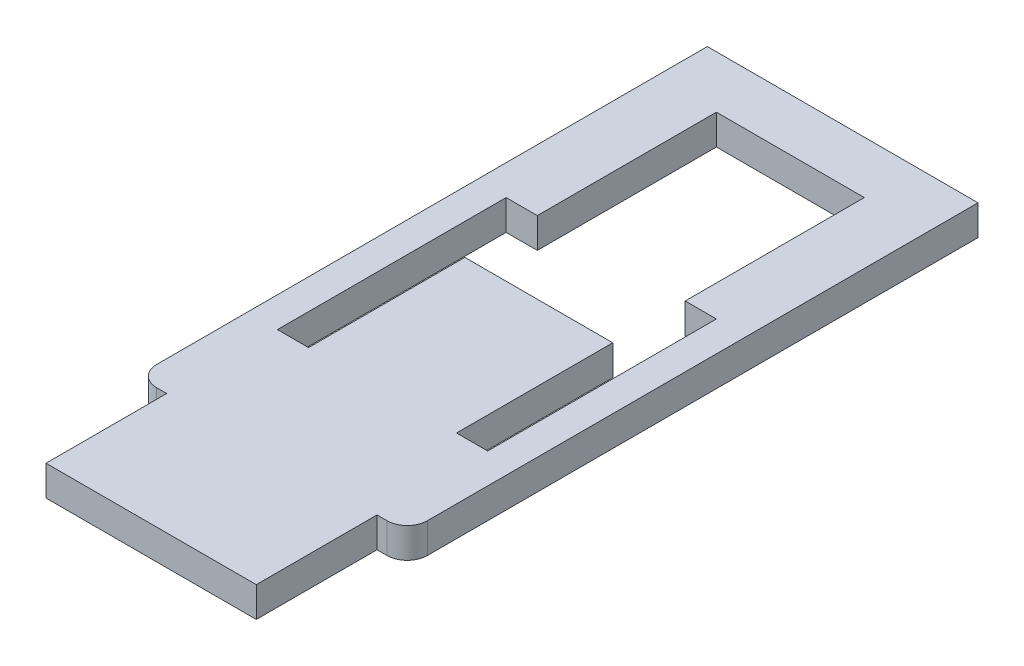
ISO-10303-21;
HEADER;
FILE_DESCRIPTION(('STEP AP214'),'2;1');
FILE_NAME('part.step','',(''),(''),'','','');
FILE_SCHEMA(('AUTOMOTIVE_DESIGN { 1 0 10303 214 1 1 1 1 }'));
ENDSEC;
DATA;
#1=APPLICATION_CONTEXT('core data for automotive mechanical design processes');
#2=APPLICATION_PROTOCOL_DEFINITION('international standard','automotive_design',2000,#1);
#3=PRODUCT_CONTEXT('',#1,'mechanical');
#4=PRODUCT('Part','Part','',(#3));
#5=PRODUCT_RELATED_PRODUCT_CATEGORY('part','',(#4));
#6=PRODUCT_DEFINITION_FORMATION('','',#4);
#7=PRODUCT_DEFINITION_CONTEXT('part definition',#1,'design');
#8=PRODUCT_DEFINITION('design','',#6,#7);
#9=PRODUCT_DEFINITION_SHAPE('','',#8);
#10=(LENGTH_UNIT() NAMED_UNIT(*) SI_UNIT(.MILLI.,.METRE.));
#11=(NAMED_UNIT(*) PLANE_ANGLE_UNIT() SI_UNIT($,.RADIAN.));
#12=(NAMED_UNIT(*) SI_UNIT($,.STERADIAN.) SOLID_ANGLE_UNIT());
#13=UNCERTAINTY_MEASURE_WITH_UNIT(LENGTH_MEASURE(1.E-05),#10,'distance_accuracy_value','');
#14=(GEOMETRIC_REPRESENTATION_CONTEXT(3) GLOBAL_UNCERTAINTY_ASSIGNED_CONTEXT((#13)) GLOBAL_UNIT_ASSIGNED_CONTEXT((#10,
#11,#12)) REPRESENTATION_CONTEXT('',''));
#15=CARTESIAN_POINT('',(0.,0.,0.));
#16=DIRECTION('',(0.,0.,1.));
#17=DIRECTION('',(1.,0.,0.));
#18=AXIS2_PLACEMENT_3D('',#15,#16,#17);
#19=CARTESIAN_POINT('',(7.35025,3.,0.));
#20=DIRECTION('',(-1.,0.,0.));
#21=DIRECTION('',(0.,0.,1.));
#22=AXIS2_PLACEMENT_3D('',#19,#20,#21);
#23=PLANE('',#22);
#24=DIRECTION('',(0.,0.,-1.));
#25=VECTOR('',#24,1.);
#26=CARTESIAN_POINT('',(7.35025,0.,0.));
#27=LINE('',#26,#25);
#28=CARTESIAN_POINT('',(7.35025,0.,-11.36565));
#29=VERTEX_POINT('',#28);
#30=CARTESIAN_POINT('',(7.35025,0.,-29.16565));
#31=VERTEX_POINT('',#30);
#32=EDGE_CURVE('E293',#29,#31,#27,.T.);
#33=ORIENTED_EDGE('',*,*,#32,.F.);
#34=DIRECTION('',(0.,-1.,0.));
#35=VECTOR('',#34,1.);
#36=CARTESIAN_POINT('',(7.35025,3.,-11.36565));
#37=LINE('',#36,#35);
#38=CARTESIAN_POINT('',(7.35025,3.,-11.36565));
#39=VERTEX_POINT('',#38);
#40=EDGE_CURVE('E350',#39,#29,#37,.T.);
#41=ORIENTED_EDGE('',*,*,#40,.F.);
#42=DIRECTION('',(0.,0.,-1.));
#43=VECTOR('',#42,1.);
#44=CARTESIAN_POINT('',(7.35025,3.,0.));
#45=LINE('',#44,#43);
#46=CARTESIAN_POINT('',(7.35025,3.,-29.16565));
#47=VERTEX_POINT('',#46);
#48=EDGE_CURVE('E239',#39,#47,#45,.T.);
#49=ORIENTED_EDGE('',*,*,#48,.T.);
#50=DIRECTION('',(0.,-1.,0.));
#51=VECTOR('',#50,1.);
#52=CARTESIAN_POINT('',(7.35025,3.,-29.16565));
#53=LINE('',#52,#51);
#54=EDGE_CURVE('E204',#47,#31,#53,.T.);
#55=ORIENTED_EDGE('',*,*,#54,.T.);
#56=EDGE_LOOP('',(#33,#41,#49,#55));
#57=FACE_BOUND('',#56,.T.);
#58=ADVANCED_FACE('F45',(#57),#23,.T.);
#59=CARTESIAN_POINT('',(0.,3.,-11.36565));
#60=DIRECTION('',(0.,0.,1.));
#61=DIRECTION('',(1.,0.,0.));
#62=AXIS2_PLACEMENT_3D('',#59,#60,#61);
#63=PLANE('',#62);
#64=DIRECTION('',(-1.,0.,0.));
#65=VECTOR('',#64,1.);
#66=CARTESIAN_POINT('',(0.,0.,-11.36565));
#67=LINE('',#66,#65);
#68=CARTESIAN_POINT('',(10.45025,0.,-11.36565));
#69=VERTEX_POINT('',#68);
#70=EDGE_CURVE('E296',#69,#29,#67,.T.);
#71=ORIENTED_EDGE('',*,*,#70,.F.);
#72=DIRECTION('',(0.,-1.,0.));
#73=VECTOR('',#72,1.);
#74=CARTESIAN_POINT('',(10.45025,3.,-11.36565));
#75=LINE('',#74,#73);
#76=CARTESIAN_POINT('',(10.45025,3.,-11.36565));
#77=VERTEX_POINT('',#76);
#78=EDGE_CURVE('E348',#77,#69,#75,.T.);
#79=ORIENTED_EDGE('',*,*,#78,.F.);
#80=DIRECTION('',(-1.,0.,0.));
#81=VECTOR('',#80,1.);
#82=CARTESIAN_POINT('',(0.,3.,-11.36565));
#83=LINE('',#82,#81);
#84=EDGE_CURVE('E242',#77,#39,#83,.T.);
#85=ORIENTED_EDGE('',*,*,#84,.T.);
#86=ORIENTED_EDGE('',*,*,#40,.T.);
#87=EDGE_LOOP('',(#71,#79,#85,#86));
#88=FACE_BOUND('',#87,.T.);
#89=ADVANCED_FACE('F405',(#88),#63,.T.);
#90=CARTESIAN_POINT('',(10.45025,3.,0.));
#91=DIRECTION('',(-1.,0.,0.));
#92=DIRECTION('',(0.,0.,1.));
#93=AXIS2_PLACEMENT_3D('',#90,#91,#92);
#94=PLANE('',#93);
#95=DIRECTION('',(0.,0.,-1.));
#96=VECTOR('',#95,1.);
#97=CARTESIAN_POINT('',(10.45025,0.,0.));
#98=LINE('',#97,#96);
#99=CARTESIAN_POINT('',(10.45025,0.,11.36565));
#100=VERTEX_POINT('',#99);
#101=EDGE_CURVE('E299',#100,#69,#98,.T.);
#102=ORIENTED_EDGE('',*,*,#101,.F.);
#103=DIRECTION('',(0.,-1.,0.));
#104=VECTOR('',#103,1.);
#105=CARTESIAN_POINT('',(10.45025,3.,11.36565));
#106=LINE('',#105,#104);
#107=CARTESIAN_POINT('',(10.45025,3.,11.36565));
#108=VERTEX_POINT('',#107);
#109=EDGE_CURVE('E346',#108,#100,#106,.T.);
#110=ORIENTED_EDGE('',*,*,#109,.F.);
#111=DIRECTION('',(0.,0.,-1.));
#112=VECTOR('',#111,1.);
#113=CARTESIAN_POINT('',(10.45025,3.,0.));
#114=LINE('',#113,#112);
#115=EDGE_CURVE('E245',#108,#77,#114,.T.);
#116=ORIENTED_EDGE('',*,*,#115,.T.);
#117=ORIENTED_EDGE('',*,*,#78,.T.);
#118=EDGE_LOOP('',(#102,#110,#116,#117));
#119=FACE_BOUND('',#118,.T.);
#120=ADVANCED_FACE('F411',(#119),#94,.T.);
#121=CARTESIAN_POINT('',(0.,3.,11.36565));
#122=DIRECTION('',(0.,0.,1.));
#123=DIRECTION('',(1.,0.,0.));
#124=AXIS2_PLACEMENT_3D('',#121,#122,#123);
#125=PLANE('',#124);
#126=DIRECTION('',(-1.,0.,0.));
#127=VECTOR('',#126,1.);
#128=CARTESIAN_POINT('',(0.,0.,11.36565));
#129=LINE('',#128,#127);
#130=CARTESIAN_POINT('',(7.35025,0.,11.36565));
#131=VERTEX_POINT('',#130);
#132=EDGE_CURVE('E302',#100,#131,#129,.T.);
#133=ORIENTED_EDGE('',*,*,#132,.T.);
#134=DIRECTION('',(0.,-1.,0.));
#135=VECTOR('',#134,1.);
#136=CARTESIAN_POINT('',(7.35025,3.,11.36565));
#137=LINE('',#136,#135);
#138=CARTESIAN_POINT('',(7.35025,3.,11.36565));
#139=VERTEX_POINT('',#138);
#140=EDGE_CURVE('E343',#139,#131,#137,.T.);
#141=ORIENTED_EDGE('',*,*,#140,.F.);
#142=DIRECTION('',(-1.,0.,0.));
#143=VECTOR('',#142,1.);
#144=CARTESIAN_POINT('',(0.,3.,11.36565));
#145=LINE('',#144,#143);
#146=EDGE_CURVE('E248',#108,#139,#145,.T.);
#147=ORIENTED_EDGE('',*,*,#146,.F.);
#148=ORIENTED_EDGE('',*,*,#109,.T.);
#149=EDGE_LOOP('',(#133,#141,#147,#148));
#150=FACE_BOUND('',#149,.T.);
#151=ADVANCED_FACE('F468',(#150),#125,.F.);
#152=CARTESIAN_POINT('',(7.35025,3.,0.));
#153=DIRECTION('',(-1.,0.,0.));
#154=DIRECTION('',(0.,0.,1.));
#155=AXIS2_PLACEMENT_3D('',#152,#153,#154);
#156=PLANE('',#155);
#157=DIRECTION('',(0.,0.,-1.));
#158=VECTOR('',#157,1.);
#159=CARTESIAN_POINT('',(7.35025,0.,0.));
#160=LINE('',#159,#158);
#161=CARTESIAN_POINT('',(7.35025,0.,-4.16565000000001));
#162=VERTEX_POINT('',#161);
#163=EDGE_CURVE('E305',#131,#162,#160,.T.);
#164=ORIENTED_EDGE('',*,*,#163,.T.);
#165=DIRECTION('',(0.,-1.,0.));
#166=VECTOR('',#165,1.);
#167=CARTESIAN_POINT('',(7.35025,3.,-4.16565000000001));
#168=LINE('',#167,#166);
#169=CARTESIAN_POINT('',(7.35025,3.,-4.16565000000001));
#170=VERTEX_POINT('',#169);
#171=EDGE_CURVE('E341',#170,#162,#168,.T.);
#172=ORIENTED_EDGE('',*,*,#171,.F.);
#173=DIRECTION('',(0.,0.,-1.));
#174=VECTOR('',#173,1.);
#175=CARTESIAN_POINT('',(7.35025,3.,0.));
#176=LINE('',#175,#174);
#177=EDGE_CURVE('E251',#139,#170,#176,.T.);
#178=ORIENTED_EDGE('',*,*,#177,.F.);
#179=ORIENTED_EDGE('',*,*,#140,.T.);
#180=EDGE_LOOP('',(#164,#172,#178,#179));
#181=FACE_BOUND('',#180,.T.);
#182=ADVANCED_FACE('F464',(#181),#156,.F.);
#183=CARTESIAN_POINT('',(0.,3.,-4.16565000000001));
#184=DIRECTION('',(0.,0.,-1.));
#185=DIRECTION('',(-1.,0.,0.));
#186=AXIS2_PLACEMENT_3D('',#183,#184,#185);
#187=PLANE('',#186);
#188=DIRECTION('',(1.,0.,0.));
#189=VECTOR('',#188,1.);
#190=CARTESIAN_POINT('',(0.,0.,-4.16565000000001));
#191=LINE('',#190,#189);
#192=CARTESIAN_POINT('',(-7.35025,0.,-4.16565000000001));
#193=VERTEX_POINT('',#192);
#194=EDGE_CURVE('E308',#193,#162,#191,.T.);
#195=ORIENTED_EDGE('',*,*,#194,.F.);
#196=DIRECTION('',(0.,-1.,0.));
#197=VECTOR('',#196,1.);
#198=CARTESIAN_POINT('',(-7.35025,3.,-4.16565000000001));
#199=LINE('',#198,#197);
#200=CARTESIAN_POINT('',(-7.35025,3.,-4.16565000000001));
#201=VERTEX_POINT('',#200);
#202=EDGE_CURVE('E339',#201,#193,#199,.T.);
#203=ORIENTED_EDGE('',*,*,#202,.F.);
#204=DIRECTION('',(1.,0.,0.));
#205=VECTOR('',#204,1.);
#206=CARTESIAN_POINT('',(0.,3.,-4.16565000000001));
#207=LINE('',#206,#205);
#208=EDGE_CURVE('E253',#201,#170,#207,.T.);
#209=ORIENTED_EDGE('',*,*,#208,.T.);
#210=ORIENTED_EDGE('',*,*,#171,.T.);
#211=EDGE_LOOP('',(#195,#203,#209,#210));
#212=FACE_BOUND('',#211,.T.);
#213=ADVANCED_FACE('F460',(#212),#187,.T.);
#214=CARTESIAN_POINT('',(-7.35025,3.,0.));
#215=DIRECTION('',(-1.,0.,0.));
#216=DIRECTION('',(0.,0.,1.));
#217=AXIS2_PLACEMENT_3D('',#214,#215,#216);
#218=PLANE('',#217);
#219=DIRECTION('',(0.,0.,-1.));
#220=VECTOR('',#219,1.);
#221=CARTESIAN_POINT('',(-7.35025,0.,0.));
#222=LINE('',#221,#220);
#223=CARTESIAN_POINT('',(-7.35025,0.,11.36565));
#224=VERTEX_POINT('',#223);
#225=EDGE_CURVE('E311',#224,#193,#222,.T.);
#226=ORIENTED_EDGE('',*,*,#225,.F.);
#227=DIRECTION('',(0.,-1.,0.));
#228=VECTOR('',#227,1.);
#229=CARTESIAN_POINT('',(-7.35025,3.,11.36565));
#230=LINE('',#229,#228);
#231=CARTESIAN_POINT('',(-7.35025,3.,11.36565));
#232=VERTEX_POINT('',#231);
#233=EDGE_CURVE('E337',#232,#224,#230,.T.);
#234=ORIENTED_EDGE('',*,*,#233,.F.);
#235=DIRECTION('',(0.,0.,-1.));
#236=VECTOR('',#235,1.);
#237=CARTESIAN_POINT('',(-7.35025,3.,0.));
#238=LINE('',#237,#236);
#239=EDGE_CURVE('E256',#232,#201,#238,.T.);
#240=ORIENTED_EDGE('',*,*,#239,.T.);
#241=ORIENTED_EDGE('',*,*,#202,.T.);
#242=EDGE_LOOP('',(#226,#234,#240,#241));
#243=FACE_BOUND('',#242,.T.);
#244=ADVANCED_FACE('F456',(#243),#218,.T.);
#245=CARTESIAN_POINT('',(0.,3.,11.36565));
#246=DIRECTION('',(0.,0.,-1.));
#247=DIRECTION('',(-1.,0.,0.));
#248=AXIS2_PLACEMENT_3D('',#245,#246,#247);
#249=PLANE('',#248);
#250=DIRECTION('',(1.,0.,0.));
#251=VECTOR('',#250,1.);
#252=CARTESIAN_POINT('',(0.,0.,11.36565));
#253=LINE('',#252,#251);
#254=CARTESIAN_POINT('',(-10.45025,0.,11.36565));
#255=VERTEX_POINT('',#254);
#256=EDGE_CURVE('E314',#255,#224,#253,.T.);
#257=ORIENTED_EDGE('',*,*,#256,.F.);
#258=DIRECTION('',(0.,-1.,0.));
#259=VECTOR('',#258,1.);
#260=CARTESIAN_POINT('',(-10.45025,3.,11.36565));
#261=LINE('',#260,#259);
#262=CARTESIAN_POINT('',(-10.45025,3.,11.36565));
#263=VERTEX_POINT('',#262);
#264=EDGE_CURVE('E335',#263,#255,#261,.T.);
#265=ORIENTED_EDGE('',*,*,#264,.F.);
#266=DIRECTION('',(1.,0.,0.));
#267=VECTOR('',#266,1.);
#268=CARTESIAN_POINT('',(0.,3.,11.36565));
#269=LINE('',#268,#267);
#270=EDGE_CURVE('E259',#263,#232,#269,.T.);
#271=ORIENTED_EDGE('',*,*,#270,.T.);
#272=ORIENTED_EDGE('',*,*,#233,.T.);
#273=EDGE_LOOP('',(#257,#265,#271,#272));
#274=FACE_BOUND('',#273,.T.);
#275=ADVANCED_FACE('F452',(#274),#249,.T.);
#276=CARTESIAN_POINT('',(-10.45025,3.,0.));
#277=DIRECTION('',(-1.,0.,0.));
#278=DIRECTION('',(0.,0.,1.));
#279=AXIS2_PLACEMENT_3D('',#276,#277,#278);
#280=PLANE('',#279);
#281=DIRECTION('',(0.,0.,-1.));
#282=VECTOR('',#281,1.);
#283=CARTESIAN_POINT('',(-10.45025,0.,0.));
#284=LINE('',#283,#282);
#285=CARTESIAN_POINT('',(-10.45025,0.,-11.36565));
#286=VERTEX_POINT('',#285);
#287=EDGE_CURVE('E317',#255,#286,#284,.T.);
#288=ORIENTED_EDGE('',*,*,#287,.T.);
#289=DIRECTION('',(0.,-1.,0.));
#290=VECTOR('',#289,1.);
#291=CARTESIAN_POINT('',(-10.45025,3.,-11.36565));
#292=LINE('',#291,#290);
#293=CARTESIAN_POINT('',(-10.45025,3.,-11.36565));
#294=VERTEX_POINT('',#293);
#295=EDGE_CURVE('E332',#294,#286,#292,.T.);
#296=ORIENTED_EDGE('',*,*,#295,.F.);
#297=DIRECTION('',(0.,0.,-1.));
#298=VECTOR('',#297,1.);
#299=CARTESIAN_POINT('',(-10.45025,3.,0.));
#300=LINE('',#299,#298);
#301=EDGE_CURVE('E262',#263,#294,#300,.T.);
#302=ORIENTED_EDGE('',*,*,#301,.F.);
#303=ORIENTED_EDGE('',*,*,#264,.T.);
#304=EDGE_LOOP('',(#288,#296,#302,#303));
#305=FACE_BOUND('',#304,.T.);
#306=ADVANCED_FACE('F444',(#305),#280,.F.);
#307=CARTESIAN_POINT('',(0.,3.,-11.36565));
#308=DIRECTION('',(0.,0.,-1.));
#309=DIRECTION('',(-1.,0.,0.));
#310=AXIS2_PLACEMENT_3D('',#307,#308,#309);
#311=PLANE('',#310);
#312=DIRECTION('',(1.,0.,0.));
#313=VECTOR('',#312,1.);
#314=CARTESIAN_POINT('',(0.,0.,-11.36565));
#315=LINE('',#314,#313);
#316=CARTESIAN_POINT('',(-7.35025,0.,-11.36565));
#317=VERTEX_POINT('',#316);
#318=EDGE_CURVE('E320',#286,#317,#315,.T.);
#319=ORIENTED_EDGE('',*,*,#318,.T.);
#320=DIRECTION('',(0.,-1.,0.));
#321=VECTOR('',#320,1.);
#322=CARTESIAN_POINT('',(-7.35025,3.,-11.36565));
#323=LINE('',#322,#321);
#324=CARTESIAN_POINT('',(-7.35025,3.,-11.36565));
#325=VERTEX_POINT('',#324);
#326=EDGE_CURVE('E329',#325,#317,#323,.T.);
#327=ORIENTED_EDGE('',*,*,#326,.F.);
#328=DIRECTION('',(1.,0.,0.));
#329=VECTOR('',#328,1.);
#330=CARTESIAN_POINT('',(0.,3.,-11.36565));
#331=LINE('',#330,#329);
#332=EDGE_CURVE('E265',#294,#325,#331,.T.);
#333=ORIENTED_EDGE('',*,*,#332,.F.);
#334=ORIENTED_EDGE('',*,*,#295,.T.);
#335=EDGE_LOOP('',(#319,#327,#333,#334));
#336=FACE_BOUND('',#335,.T.);
#337=ADVANCED_FACE('F438',(#336),#311,.F.);
#338=CARTESIAN_POINT('',(-7.35025,3.,0.));
#339=DIRECTION('',(-1.,0.,0.));
#340=DIRECTION('',(0.,0.,1.));
#341=AXIS2_PLACEMENT_3D('',#338,#339,#340);
#342=PLANE('',#341);
#343=DIRECTION('',(0.,0.,-1.));
#344=VECTOR('',#343,1.);
#345=CARTESIAN_POINT('',(-7.35025,0.,0.));
#346=LINE('',#345,#344);
#347=CARTESIAN_POINT('',(-7.35025,0.,-29.16565));
#348=VERTEX_POINT('',#347);
#349=EDGE_CURVE('E224',#317,#348,#346,.T.);
#350=ORIENTED_EDGE('',*,*,#349,.T.);
#351=DIRECTION('',(0.,-1.,0.));
#352=VECTOR('',#351,1.);
#353=CARTESIAN_POINT('',(-7.35025,3.,-29.16565));
#354=LINE('',#353,#352);
#355=CARTESIAN_POINT('',(-7.35025,3.,-29.16565));
#356=VERTEX_POINT('',#355);
#357=EDGE_CURVE('E326',#356,#348,#354,.T.);
#358=ORIENTED_EDGE('',*,*,#357,.F.);
#359=DIRECTION('',(0.,0.,-1.));
#360=VECTOR('',#359,1.);
#361=CARTESIAN_POINT('',(-7.35025,3.,0.));
#362=LINE('',#361,#360);
#363=EDGE_CURVE('E268',#325,#356,#362,.T.);
#364=ORIENTED_EDGE('',*,*,#363,.F.);
#365=ORIENTED_EDGE('',*,*,#326,.T.);
#366=EDGE_LOOP('',(#350,#358,#364,#365));
#367=FACE_BOUND('',#366,.T.);
#368=ADVANCED_FACE('F434',(#367),#342,.F.);
#369=CARTESIAN_POINT('',(10.45025,3.,0.));
#370=DIRECTION('',(1.,0.,0.));
#371=DIRECTION('',(0.,0.,-1.));
#372=AXIS2_PLACEMENT_3D('',#369,#370,#371);
#373=PLANE('',#372);
#374=DIRECTION('',(0.,0.,1.));
#375=VECTOR('',#374,1.);
#376=CARTESIAN_POINT('',(10.45025,0.,0.));
#377=LINE('',#376,#375);
#378=CARTESIAN_POINT('',(10.45025,0.,22.36565));
#379=VERTEX_POINT('',#378);
#380=CARTESIAN_POINT('',(10.45025,0.,34.36565));
#381=VERTEX_POINT('',#380);
#382=EDGE_CURVE('E200',#379,#381,#377,.T.);
#383=ORIENTED_EDGE('',*,*,#382,.F.);
#384=DIRECTION('',(0.,-1.,0.));
#385=VECTOR('',#384,1.);
#386=CARTESIAN_POINT('',(10.45025,3.,22.36565));
#387=LINE('',#386,#385);
#388=CARTESIAN_POINT('',(10.45025,3.,22.36565));
#389=VERTEX_POINT('',#388);
#390=EDGE_CURVE('E194',#389,#379,#387,.T.);
#391=ORIENTED_EDGE('',*,*,#390,.F.);
#392=DIRECTION('',(0.,0.,1.));
#393=VECTOR('',#392,1.);
#394=CARTESIAN_POINT('',(10.45025,3.,0.));
#395=LINE('',#394,#393);
#396=CARTESIAN_POINT('',(10.45025,3.,34.36565));
#397=VERTEX_POINT('',#396);
#398=EDGE_CURVE('E198',#389,#397,#395,.T.);
#399=ORIENTED_EDGE('',*,*,#398,.T.);
#400=DIRECTION('',(0.,-1.,0.));
#401=VECTOR('',#400,1.);
#402=CARTESIAN_POINT('',(10.45025,3.,34.36565));
#403=LINE('',#402,#401);
#404=EDGE_CURVE('E273',#397,#381,#403,.T.);
#405=ORIENTED_EDGE('',*,*,#404,.T.);
#406=EDGE_LOOP('',(#383,#391,#399,#405));
#407=FACE_BOUND('',#406,.T.);
#408=ADVANCED_FACE('F196',(#407),#373,.T.);
#409=CARTESIAN_POINT('',(0.,3.,22.36565));
#410=DIRECTION('',(0.,0.,-1.));
#411=DIRECTION('',(-1.,0.,0.));
#412=AXIS2_PLACEMENT_3D('',#409,#410,#411);
#413=PLANE('',#412);
#414=DIRECTION('',(1.,0.,0.));
#415=VECTOR('',#414,1.);
#416=CARTESIAN_POINT('',(0.,0.,22.36565));
#417=LINE('',#416,#415);
#418=CARTESIAN_POINT('',(11.45025,0.,22.36565));
#419=VERTEX_POINT('',#418);
#420=EDGE_CURVE('E275',#379,#419,#417,.T.);
#421=ORIENTED_EDGE('',*,*,#420,.T.);
#422=DIRECTION('',(0.,-1.,0.));
#423=VECTOR('',#422,1.);
#424=CARTESIAN_POINT('',(11.45025,3.,22.36565));
#425=LINE('',#424,#423);
#426=CARTESIAN_POINT('',(11.45025,3.,22.36565));
#427=VERTEX_POINT('',#426);
#428=EDGE_CURVE('E211',#419,#427,#425,.F.);
#429=ORIENTED_EDGE('',*,*,#428,.T.);
#430=DIRECTION('',(1.,0.,0.));
#431=VECTOR('',#430,1.);
#432=CARTESIAN_POINT('',(0.,3.,22.36565));
#433=LINE('',#432,#431);
#434=EDGE_CURVE('E208',#389,#427,#433,.T.);
#435=ORIENTED_EDGE('',*,*,#434,.F.);
#436=ORIENTED_EDGE('',*,*,#390,.T.);
#437=EDGE_LOOP('',(#421,#429,#435,#436));
#438=FACE_BOUND('',#437,.T.);
#439=ADVANCED_FACE('F209',(#438),#413,.F.);
#440=CARTESIAN_POINT('',(13.45025,3.,0.));
#441=DIRECTION('',(-1.,0.,0.));
#442=DIRECTION('',(0.,0.,1.));
#443=AXIS2_PLACEMENT_3D('',#440,#441,#442);
#444=PLANE('',#443);
#445=DIRECTION('',(0.,0.,-1.));
#446=VECTOR('',#445,1.);
#447=CARTESIAN_POINT('',(13.45025,3.,0.));
#448=LINE('',#447,#446);
#449=CARTESIAN_POINT('',(13.45025,3.,20.36565));
#450=VERTEX_POINT('',#449);
#451=CARTESIAN_POINT('',(13.45025,3.,-34.36565));
#452=VERTEX_POINT('',#451);
#453=EDGE_CURVE('E213',#450,#452,#448,.T.);
#454=ORIENTED_EDGE('',*,*,#453,.F.);
#455=DIRECTION('',(0.,-1.,0.));
#456=VECTOR('',#455,1.);
#457=CARTESIAN_POINT('',(13.45025,3.,20.36565));
#458=LINE('',#457,#456);
#459=CARTESIAN_POINT('',(13.45025,0.,20.36565));
#460=VERTEX_POINT('',#459);
#461=EDGE_CURVE('E352',#450,#460,#458,.T.);
#462=ORIENTED_EDGE('',*,*,#461,.T.);
#463=DIRECTION('',(0.,0.,-1.));
#464=VECTOR('',#463,1.);
#465=CARTESIAN_POINT('',(13.45025,0.,0.));
#466=LINE('',#465,#464);
#467=CARTESIAN_POINT('',(13.45025,0.,-34.36565));
#468=VERTEX_POINT('',#467);
#469=EDGE_CURVE('E277',#460,#468,#466,.T.);
#470=ORIENTED_EDGE('',*,*,#469,.T.);
#471=DIRECTION('',(0.,-1.,0.));
#472=VECTOR('',#471,1.);
#473=CARTESIAN_POINT('',(13.45025,3.,-34.36565));
#474=LINE('',#473,#472);
#475=EDGE_CURVE('E205',#452,#468,#474,.T.);
#476=ORIENTED_EDGE('',*,*,#475,.F.);
#477=EDGE_LOOP('',(#454,#462,#470,#476));
#478=FACE_BOUND('',#477,.T.);
#479=ADVANCED_FACE('F395',(#478),#444,.F.);
#480=CARTESIAN_POINT('',(0.,3.,-34.36565));
#481=DIRECTION('',(0.,0.,-1.));
#482=DIRECTION('',(-1.,0.,0.));
#483=AXIS2_PLACEMENT_3D('',#480,#481,#482);
#484=PLANE('',#483);
#485=DIRECTION('',(1.,0.,0.));
#486=VECTOR('',#485,1.);
#487=CARTESIAN_POINT('',(0.,0.,-34.36565));
#488=LINE('',#487,#486);
#489=CARTESIAN_POINT('',(-13.45025,0.,-34.36565));
#490=VERTEX_POINT('',#489);
#491=EDGE_CURVE('E279',#490,#468,#488,.T.);
#492=ORIENTED_EDGE('',*,*,#491,.F.);
#493=DIRECTION('',(0.,-1.,0.));
#494=VECTOR('',#493,1.);
#495=CARTESIAN_POINT('',(-13.45025,3.,-34.36565));
#496=LINE('',#495,#494);
#497=CARTESIAN_POINT('',(-13.45025,3.,-34.36565));
#498=VERTEX_POINT('',#497);
#499=EDGE_CURVE('E358',#498,#490,#496,.T.);
#500=ORIENTED_EDGE('',*,*,#499,.F.);
#501=DIRECTION('',(1.,0.,0.));
#502=VECTOR('',#501,1.);
#503=CARTESIAN_POINT('',(0.,3.,-34.36565));
#504=LINE('',#503,#502);
#505=EDGE_CURVE('E228',#498,#452,#504,.T.);
#506=ORIENTED_EDGE('',*,*,#505,.T.);
#507=ORIENTED_EDGE('',*,*,#475,.T.);
#508=EDGE_LOOP('',(#492,#500,#506,#507));
#509=FACE_BOUND('',#508,.T.);
#510=ADVANCED_FACE('F399',(#509),#484,.T.);
#511=CARTESIAN_POINT('',(-13.45025,3.,0.));
#512=DIRECTION('',(-1.,0.,0.));
#513=DIRECTION('',(0.,0.,1.));
#514=AXIS2_PLACEMENT_3D('',#511,#512,#513);
#515=PLANE('',#514);
#516=DIRECTION('',(0.,0.,-1.));
#517=VECTOR('',#516,1.);
#518=CARTESIAN_POINT('',(-13.45025,0.,0.));
#519=LINE('',#518,#517);
#520=CARTESIAN_POINT('',(-13.45025,0.,20.36565));
#521=VERTEX_POINT('',#520);
#522=EDGE_CURVE('E282',#521,#490,#519,.T.);
#523=ORIENTED_EDGE('',*,*,#522,.F.);
#524=DIRECTION('',(0.,-1.,0.));
#525=VECTOR('',#524,1.);
#526=CARTESIAN_POINT('',(-13.45025,3.,20.36565));
#527=LINE('',#526,#525);
#528=CARTESIAN_POINT('',(-13.45025,3.,20.36565));
#529=VERTEX_POINT('',#528);
#530=EDGE_CURVE('E11',#521,#529,#527,.F.);
#531=ORIENTED_EDGE('',*,*,#530,.T.);
#532=DIRECTION('',(0.,0.,-1.));
#533=VECTOR('',#532,1.);
#534=CARTESIAN_POINT('',(-13.45025,3.,0.));
#535=LINE('',#534,#533);
#536=EDGE_CURVE('E231',#529,#498,#535,.T.);
#537=ORIENTED_EDGE('',*,*,#536,.T.);
#538=ORIENTED_EDGE('',*,*,#499,.T.);
#539=EDGE_LOOP('',(#523,#531,#537,#538));
#540=FACE_BOUND('',#539,.T.);
#541=ADVANCED_FACE('F424',(#540),#515,.T.);
#542=CARTESIAN_POINT('',(0.,3.,22.36565));
#543=DIRECTION('',(0.,0.,1.));
#544=DIRECTION('',(1.,0.,0.));
#545=AXIS2_PLACEMENT_3D('',#542,#543,#544);
#546=PLANE('',#545);
#547=DIRECTION('',(-1.,0.,0.));
#548=VECTOR('',#547,1.);
#549=CARTESIAN_POINT('',(0.,3.,22.36565));
#550=LINE('',#549,#548);
#551=CARTESIAN_POINT('',(-10.45025,3.,22.36565));
#552=VERTEX_POINT('',#551);
#553=CARTESIAN_POINT('',(-11.45025,3.,22.36565));
#554=VERTEX_POINT('',#553);
#555=EDGE_CURVE('E233',#552,#554,#550,.T.);
#556=ORIENTED_EDGE('',*,*,#555,.T.);
#557=DIRECTION('',(0.,-1.,0.));
#558=VECTOR('',#557,1.);
#559=CARTESIAN_POINT('',(-11.45025,3.,22.36565));
#560=LINE('',#559,#558);
#561=CARTESIAN_POINT('',(-11.45025,0.,22.36565));
#562=VERTEX_POINT('',#561);
#563=EDGE_CURVE('E53',#554,#562,#560,.T.);
#564=ORIENTED_EDGE('',*,*,#563,.T.);
#565=DIRECTION('',(-1.,0.,0.));
#566=VECTOR('',#565,1.);
#567=CARTESIAN_POINT('',(0.,0.,22.36565));
#568=LINE('',#567,#566);
#569=CARTESIAN_POINT('',(-10.45025,0.,22.36565));
#570=VERTEX_POINT('',#569);
#571=EDGE_CURVE('E284',#570,#562,#568,.T.);
#572=ORIENTED_EDGE('',*,*,#571,.F.);
#573=DIRECTION('',(0.,-1.,0.));
#574=VECTOR('',#573,1.);
#575=CARTESIAN_POINT('',(-10.45025,3.,22.36565));
#576=LINE('',#575,#574);
#577=EDGE_CURVE('E356',#552,#570,#576,.T.);
#578=ORIENTED_EDGE('',*,*,#577,.F.);
#579=EDGE_LOOP('',(#556,#564,#572,#578));
#580=FACE_BOUND('',#579,.T.);
#581=ADVANCED_FACE('F376',(#580),#546,.T.);
#582=CARTESIAN_POINT('',(-10.45025,3.,0.));
#583=DIRECTION('',(-1.,0.,0.));
#584=DIRECTION('',(0.,0.,1.));
#585=AXIS2_PLACEMENT_3D('',#582,#583,#584);
#586=PLANE('',#585);
#587=DIRECTION('',(0.,0.,-1.));
#588=VECTOR('',#587,1.);
#589=CARTESIAN_POINT('',(-10.45025,0.,0.));
#590=LINE('',#589,#588);
#591=CARTESIAN_POINT('',(-10.45025,0.,34.36565));
#592=VERTEX_POINT('',#591);
#593=EDGE_CURVE('E287',#592,#570,#590,.T.);
#594=ORIENTED_EDGE('',*,*,#593,.F.);
#595=DIRECTION('',(0.,-1.,0.));
#596=VECTOR('',#595,1.);
#597=CARTESIAN_POINT('',(-10.45025,3.,34.36565));
#598=LINE('',#597,#596);
#599=CARTESIAN_POINT('',(-10.45025,3.,34.36565));
#600=VERTEX_POINT('',#599);
#601=EDGE_CURVE('E354',#600,#592,#598,.T.);
#602=ORIENTED_EDGE('',*,*,#601,.F.);
#603=DIRECTION('',(0.,0.,-1.));
#604=VECTOR('',#603,1.);
#605=CARTESIAN_POINT('',(-10.45025,3.,0.));
#606=LINE('',#605,#604);
#607=EDGE_CURVE('E235',#600,#552,#606,.T.);
#608=ORIENTED_EDGE('',*,*,#607,.T.);
#609=ORIENTED_EDGE('',*,*,#577,.T.);
#610=EDGE_LOOP('',(#594,#602,#608,#609));
#611=FACE_BOUND('',#610,.T.);
#612=ADVANCED_FACE('F385',(#611),#586,.T.);
#613=CARTESIAN_POINT('',(0.,3.,34.36565));
#614=DIRECTION('',(0.,0.,-1.));
#615=DIRECTION('',(-1.,0.,0.));
#616=AXIS2_PLACEMENT_3D('',#613,#614,#615);
#617=PLANE('',#616);
#618=DIRECTION('',(1.,0.,0.));
#619=VECTOR('',#618,1.);
#620=CARTESIAN_POINT('',(0.,0.,34.36565));
#621=LINE('',#620,#619);
#622=EDGE_CURVE('E290',#592,#381,#621,.T.);
#623=ORIENTED_EDGE('',*,*,#622,.T.);
#624=ORIENTED_EDGE('',*,*,#404,.F.);
#625=DIRECTION('',(1.,0.,0.));
#626=VECTOR('',#625,1.);
#627=CARTESIAN_POINT('',(0.,3.,34.36565));
#628=LINE('',#627,#626);
#629=EDGE_CURVE('E219',#600,#397,#628,.T.);
#630=ORIENTED_EDGE('',*,*,#629,.F.);
#631=ORIENTED_EDGE('',*,*,#601,.T.);
#632=EDGE_LOOP('',(#623,#624,#630,#631));
#633=FACE_BOUND('',#632,.T.);
#634=ADVANCED_FACE('F387',(#633),#617,.F.);
#635=CARTESIAN_POINT('',(0.,3.,-29.16565));
#636=DIRECTION('',(0.,0.,-1.));
#637=DIRECTION('',(-1.,0.,0.));
#638=AXIS2_PLACEMENT_3D('',#635,#636,#637);
#639=PLANE('',#638);
#640=DIRECTION('',(1.,0.,0.));
#641=VECTOR('',#640,1.);
#642=CARTESIAN_POINT('',(0.,0.,-29.16565));
#643=LINE('',#642,#641);
#644=EDGE_CURVE('E221',#348,#31,#643,.T.);
#645=ORIENTED_EDGE('',*,*,#644,.T.);
#646=ORIENTED_EDGE('',*,*,#54,.F.);
#647=DIRECTION('',(1.,0.,0.));
#648=VECTOR('',#647,1.);
#649=CARTESIAN_POINT('',(0.,3.,-29.16565));
#650=LINE('',#649,#648);
#651=EDGE_CURVE('E271',#356,#47,#650,.T.);
#652=ORIENTED_EDGE('',*,*,#651,.F.);
#653=ORIENTED_EDGE('',*,*,#357,.T.);
#654=EDGE_LOOP('',(#645,#646,#652,#653));
#655=FACE_BOUND('',#654,.T.);
#656=ADVANCED_FACE('F419',(#655),#639,.F.);
#657=CARTESIAN_POINT('',(0.,3.,0.));
#658=DIRECTION('',(0.,1.,0.));
#659=DIRECTION('',(0.,0.,1.));
#660=AXIS2_PLACEMENT_3D('',#657,#658,#659);
#661=PLANE('',#660);
#662=ORIENTED_EDGE('',*,*,#434,.T.);
#663=CARTESIAN_POINT('',(11.45025,3.,20.36565));
#664=DIRECTION('',(0.,1.,0.));
#665=DIRECTION('',(0.,0.,1.));
#666=AXIS2_PLACEMENT_3D('',#663,#664,#665);
#667=CIRCLE('',#666,2.);
#668=EDGE_CURVE('E371',#427,#450,#667,.T.);
#669=ORIENTED_EDGE('',*,*,#668,.T.);
#670=ORIENTED_EDGE('',*,*,#453,.T.);
#671=ORIENTED_EDGE('',*,*,#505,.F.);
#672=ORIENTED_EDGE('',*,*,#536,.F.);
#673=CARTESIAN_POINT('',(-11.45025,3.,20.36565));
#674=DIRECTION('',(0.,1.,0.));
#675=DIRECTION('',(0.,0.,1.));
#676=AXIS2_PLACEMENT_3D('',#673,#674,#675);
#677=CIRCLE('',#676,2.);
#678=EDGE_CURVE('E60',#529,#554,#677,.T.);
#679=ORIENTED_EDGE('',*,*,#678,.T.);
#680=ORIENTED_EDGE('',*,*,#555,.F.);
#681=ORIENTED_EDGE('',*,*,#607,.F.);
#682=ORIENTED_EDGE('',*,*,#629,.T.);
#683=ORIENTED_EDGE('',*,*,#398,.F.);
#684=EDGE_LOOP('',(#662,#669,#670,#671,#672,#679,#680,#681,#682,#683));
#685=FACE_BOUND('',#684,.T.);
#686=ORIENTED_EDGE('',*,*,#48,.F.);
#687=ORIENTED_EDGE('',*,*,#84,.F.);
#688=ORIENTED_EDGE('',*,*,#115,.F.);
#689=ORIENTED_EDGE('',*,*,#146,.T.);
#690=ORIENTED_EDGE('',*,*,#177,.T.);
#691=ORIENTED_EDGE('',*,*,#208,.F.);
#692=ORIENTED_EDGE('',*,*,#239,.F.);
#693=ORIENTED_EDGE('',*,*,#270,.F.);
#694=ORIENTED_EDGE('',*,*,#301,.T.);
#695=ORIENTED_EDGE('',*,*,#332,.T.);
#696=ORIENTED_EDGE('',*,*,#363,.T.);
#697=ORIENTED_EDGE('',*,*,#651,.T.);
#698=EDGE_LOOP('',(#686,#687,#688,#689,#690,#691,#692,#693,#694,#695,#696,#697));
#699=FACE_BOUND('',#698,.T.);
#700=ADVANCED_FACE('F215',(#685,#699),#661,.T.);
#701=CARTESIAN_POINT('',(0.,0.,0.));
#702=DIRECTION('',(0.,1.,0.));
#703=DIRECTION('',(0.,0.,1.));
#704=AXIS2_PLACEMENT_3D('',#701,#702,#703);
#705=PLANE('',#704);
#706=ORIENTED_EDGE('',*,*,#469,.F.);
#707=CARTESIAN_POINT('',(11.45025,0.,20.36565));
#708=DIRECTION('',(0.,1.,0.));
#709=DIRECTION('',(0.,0.,1.));
#710=AXIS2_PLACEMENT_3D('',#707,#708,#709);
#711=CIRCLE('',#710,2.);
#712=EDGE_CURVE('E367',#460,#419,#711,.F.);
#713=ORIENTED_EDGE('',*,*,#712,.T.);
#714=ORIENTED_EDGE('',*,*,#420,.F.);
#715=ORIENTED_EDGE('',*,*,#382,.T.);
#716=ORIENTED_EDGE('',*,*,#622,.F.);
#717=ORIENTED_EDGE('',*,*,#593,.T.);
#718=ORIENTED_EDGE('',*,*,#571,.T.);
#719=CARTESIAN_POINT('',(-11.45025,0.,20.36565));
#720=DIRECTION('',(0.,1.,0.));
#721=DIRECTION('',(0.,0.,1.));
#722=AXIS2_PLACEMENT_3D('',#719,#720,#721);
#723=CIRCLE('',#722,2.);
#724=EDGE_CURVE('E365',#562,#521,#723,.F.);
#725=ORIENTED_EDGE('',*,*,#724,.T.);
#726=ORIENTED_EDGE('',*,*,#522,.T.);
#727=ORIENTED_EDGE('',*,*,#491,.T.);
#728=EDGE_LOOP('',(#706,#713,#714,#715,#716,#717,#718,#725,#726,#727));
#729=FACE_BOUND('',#728,.T.);
#730=ORIENTED_EDGE('',*,*,#32,.T.);
#731=ORIENTED_EDGE('',*,*,#644,.F.);
#732=ORIENTED_EDGE('',*,*,#349,.F.);
#733=ORIENTED_EDGE('',*,*,#318,.F.);
#734=ORIENTED_EDGE('',*,*,#287,.F.);
#735=ORIENTED_EDGE('',*,*,#256,.T.);
#736=ORIENTED_EDGE('',*,*,#225,.T.);
#737=ORIENTED_EDGE('',*,*,#194,.T.);
#738=ORIENTED_EDGE('',*,*,#163,.F.);
#739=ORIENTED_EDGE('',*,*,#132,.F.);
#740=ORIENTED_EDGE('',*,*,#101,.T.);
#741=ORIENTED_EDGE('',*,*,#70,.T.);
#742=EDGE_LOOP('',(#730,#731,#732,#733,#734,#735,#736,#737,#738,#739,#740,#741));
#743=FACE_BOUND('',#742,.T.);
#744=ADVANCED_FACE('F380',(#729,#743),#705,.F.);
#745=CARTESIAN_POINT('',(11.45025,3.,20.36565));
#746=DIRECTION('',(0.,-1.,0.));
#747=DIRECTION('',(0.,0.,-1.));
#748=AXIS2_PLACEMENT_3D('',#745,#746,#747);
#749=CYLINDRICAL_SURFACE('',#748,2.);
#750=ORIENTED_EDGE('',*,*,#668,.F.);
#751=ORIENTED_EDGE('',*,*,#428,.F.);
#752=ORIENTED_EDGE('',*,*,#712,.F.);
#753=ORIENTED_EDGE('',*,*,#461,.F.);
#754=EDGE_LOOP('',(#750,#751,#752,#753));
#755=FACE_BOUND('',#754,.T.);
#756=ADVANCED_FACE('F389',(#755),#749,.T.);
#757=CARTESIAN_POINT('',(-11.45025,3.,20.36565));
#758=DIRECTION('',(0.,-1.,0.));
#759=DIRECTION('',(0.,0.,-1.));
#760=AXIS2_PLACEMENT_3D('',#757,#758,#759);
#761=CYLINDRICAL_SURFACE('',#760,2.);
#762=ORIENTED_EDGE('',*,*,#678,.F.);
#763=ORIENTED_EDGE('',*,*,#530,.F.);
#764=ORIENTED_EDGE('',*,*,#724,.F.);
#765=ORIENTED_EDGE('',*,*,#563,.F.);
#766=EDGE_LOOP('',(#762,#763,#764,#765));
#767=FACE_BOUND('',#766,.T.);
#768=ADVANCED_FACE('F47',(#767),#761,.T.);
#769=CLOSED_SHELL('',(#58,#89,#120,#151,#182,#213,#244,#275,#306,#337,#368,#408,#439,#479,#510,
#541,#581,#612,#634,#656,#700,#744,#756,#768));
#770=MANIFOLD_SOLID_BREP('B2',#769);
#771=ADVANCED_BREP_SHAPE_REPRESENTATION('',(#18,#770),#14);
#772=SHAPE_DEFINITION_REPRESENTATION(#9,#771);
ENDSEC;
END-ISO-10303-21;
